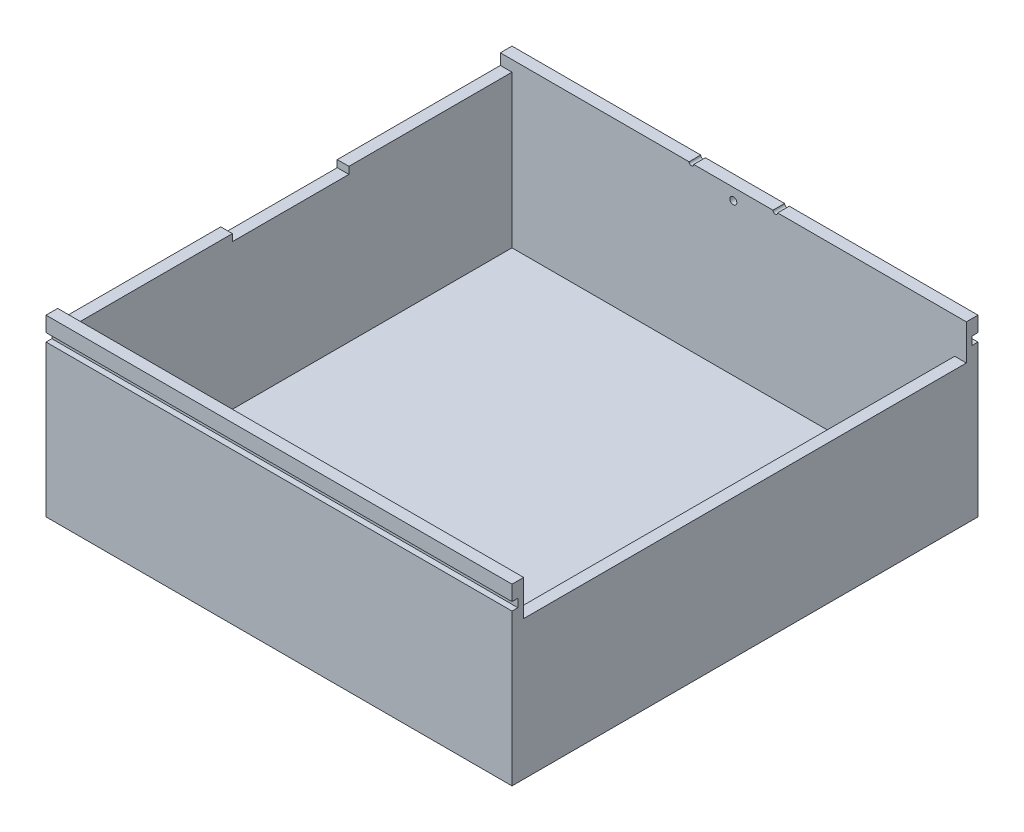
ISO-10303-21;
HEADER;
FILE_DESCRIPTION(('STEP AP214'),'2;1');
FILE_NAME('part.step','',(''),(''),'','','');
FILE_SCHEMA(('AUTOMOTIVE_DESIGN { 1 0 10303 214 1 1 1 1 }'));
ENDSEC;
DATA;
#1=APPLICATION_CONTEXT('core data for automotive mechanical design processes');
#2=APPLICATION_PROTOCOL_DEFINITION('international standard','automotive_design',2000,#1);
#3=PRODUCT_CONTEXT('',#1,'mechanical');
#4=PRODUCT('Part','Part','',(#3));
#5=PRODUCT_RELATED_PRODUCT_CATEGORY('part','',(#4));
#6=PRODUCT_DEFINITION_FORMATION('','',#4);
#7=PRODUCT_DEFINITION_CONTEXT('part definition',#1,'design');
#8=PRODUCT_DEFINITION('design','',#6,#7);
#9=PRODUCT_DEFINITION_SHAPE('','',#8);
#10=(LENGTH_UNIT() NAMED_UNIT(*) SI_UNIT(.MILLI.,.METRE.));
#11=(NAMED_UNIT(*) PLANE_ANGLE_UNIT() SI_UNIT($,.RADIAN.));
#12=(NAMED_UNIT(*) SI_UNIT($,.STERADIAN.) SOLID_ANGLE_UNIT());
#13=UNCERTAINTY_MEASURE_WITH_UNIT(LENGTH_MEASURE(1.E-05),#10,'distance_accuracy_value','');
#14=(GEOMETRIC_REPRESENTATION_CONTEXT(3) GLOBAL_UNCERTAINTY_ASSIGNED_CONTEXT((#13)) GLOBAL_UNIT_ASSIGNED_CONTEXT((#10,
#11,#12)) REPRESENTATION_CONTEXT('',''));
#15=CARTESIAN_POINT('',(0.,0.,0.));
#16=DIRECTION('',(0.,0.,1.));
#17=DIRECTION('',(1.,0.,0.));
#18=AXIS2_PLACEMENT_3D('',#15,#16,#17);
#19=CARTESIAN_POINT('',(100.,5.,100.));
#20=DIRECTION('',(0.,0.,-1.));
#21=DIRECTION('',(-1.,0.,0.));
#22=AXIS2_PLACEMENT_3D('',#19,#20,#21);
#23=PLANE('',#22);
#24=DIRECTION('',(0.,-1.,0.));
#25=VECTOR('',#24,1.);
#26=CARTESIAN_POINT('',(100.,5.,100.));
#27=LINE('',#26,#25);
#28=CARTESIAN_POINT('',(100.,65.,100.));
#29=VERTEX_POINT('',#28);
#30=CARTESIAN_POINT('',(100.,0.,100.));
#31=VERTEX_POINT('',#30);
#32=EDGE_CURVE('E475',#29,#31,#27,.T.);
#33=ORIENTED_EDGE('',*,*,#32,.F.);
#34=DIRECTION('',(1.,0.,0.));
#35=VECTOR('',#34,1.);
#36=CARTESIAN_POINT('',(100.,65.,100.));
#37=LINE('',#36,#35);
#38=CARTESIAN_POINT('',(-100.,65.,100.));
#39=VERTEX_POINT('',#38);
#40=EDGE_CURVE('E305',#39,#29,#37,.T.);
#41=ORIENTED_EDGE('',*,*,#40,.F.);
#42=DIRECTION('',(0.,-1.,0.));
#43=VECTOR('',#42,1.);
#44=CARTESIAN_POINT('',(-100.,5.,100.));
#45=LINE('',#44,#43);
#46=CARTESIAN_POINT('',(-100.,0.,100.));
#47=VERTEX_POINT('',#46);
#48=EDGE_CURVE('E43',#39,#47,#45,.T.);
#49=ORIENTED_EDGE('',*,*,#48,.T.);
#50=DIRECTION('',(1.,0.,0.));
#51=VECTOR('',#50,1.);
#52=CARTESIAN_POINT('',(100.,0.,100.));
#53=LINE('',#52,#51);
#54=EDGE_CURVE('E461',#47,#31,#53,.T.);
#55=ORIENTED_EDGE('',*,*,#54,.T.);
#56=EDGE_LOOP('',(#33,#41,#49,#55));
#57=FACE_BOUND('',#56,.T.);
#58=ADVANCED_FACE('F35',(#57),#23,.F.);
#59=CARTESIAN_POINT('',(100.,75.,-95.));
#60=DIRECTION('',(0.,0.,-1.));
#61=DIRECTION('',(-1.,0.,0.));
#62=AXIS2_PLACEMENT_3D('',#59,#60,#61);
#63=PLANE('',#62);
#64=CARTESIAN_POINT('',(0.,70.,-95.));
#65=DIRECTION('',(0.,0.,-1.));
#66=DIRECTION('',(-1.,0.,0.));
#67=AXIS2_PLACEMENT_3D('',#64,#65,#66);
#68=CIRCLE('',#67,1.5);
#69=CARTESIAN_POINT('',(-1.50000000000001,70.,-95.));
#70=VERTEX_POINT('',#69);
#71=EDGE_CURVE('E325',#70,#70,#68,.T.);
#72=ORIENTED_EDGE('',*,*,#71,.T.);
#73=EDGE_LOOP('',(#72));
#74=FACE_BOUND('',#73,.T.);
#75=CARTESIAN_POINT('',(-18.,75.,-95.));
#76=DIRECTION('',(0.,0.,1.));
#77=DIRECTION('',(1.,0.,0.));
#78=AXIS2_PLACEMENT_3D('',#75,#76,#77);
#79=CIRCLE('',#78,1.);
#80=CARTESIAN_POINT('',(-19.,75.,-95.));
#81=VERTEX_POINT('',#80);
#82=CARTESIAN_POINT('',(-17.,75.,-95.));
#83=VERTEX_POINT('',#82);
#84=EDGE_CURVE('E331',#81,#83,#79,.T.);
#85=ORIENTED_EDGE('',*,*,#84,.F.);
#86=DIRECTION('',(1.,0.,0.));
#87=VECTOR('',#86,1.);
#88=CARTESIAN_POINT('',(100.,75.,-95.));
#89=LINE('',#88,#87);
#90=CARTESIAN_POINT('',(-100.,75.,-95.));
#91=VERTEX_POINT('',#90);
#92=EDGE_CURVE('E410',#91,#81,#89,.T.);
#93=ORIENTED_EDGE('',*,*,#92,.F.);
#94=DIRECTION('',(0.,-1.,0.));
#95=VECTOR('',#94,1.);
#96=CARTESIAN_POINT('',(-100.,75.,-95.));
#97=LINE('',#96,#95);
#98=CARTESIAN_POINT('',(-100.,70.3,-95.));
#99=VERTEX_POINT('',#98);
#100=EDGE_CURVE('E418',#91,#99,#97,.T.);
#101=ORIENTED_EDGE('',*,*,#100,.T.);
#102=DIRECTION('',(-1.,0.,0.));
#103=VECTOR('',#102,1.);
#104=CARTESIAN_POINT('',(-100.,70.3,-95.));
#105=LINE('',#104,#103);
#106=CARTESIAN_POINT('',(-95.,70.3,-95.));
#107=VERTEX_POINT('',#106);
#108=EDGE_CURVE('E388',#107,#99,#105,.T.);
#109=ORIENTED_EDGE('',*,*,#108,.F.);
#110=DIRECTION('',(0.,-1.,0.));
#111=VECTOR('',#110,1.);
#112=CARTESIAN_POINT('',(-95.,70.3,-95.));
#113=LINE('',#112,#111);
#114=CARTESIAN_POINT('',(-95.,5.,-95.));
#115=VERTEX_POINT('',#114);
#116=EDGE_CURVE('E391',#107,#115,#113,.T.);
#117=ORIENTED_EDGE('',*,*,#116,.T.);
#118=DIRECTION('',(1.,0.,0.));
#119=VECTOR('',#118,1.);
#120=CARTESIAN_POINT('',(100.,5.,-95.));
#121=LINE('',#120,#119);
#122=CARTESIAN_POINT('',(95.,5.,-95.));
#123=VERTEX_POINT('',#122);
#124=EDGE_CURVE('E398',#115,#123,#121,.T.);
#125=ORIENTED_EDGE('',*,*,#124,.T.);
#126=DIRECTION('',(0.,-1.,0.));
#127=VECTOR('',#126,1.);
#128=CARTESIAN_POINT('',(95.,59.7,-95.));
#129=LINE('',#128,#127);
#130=CARTESIAN_POINT('',(95.,59.7,-95.));
#131=VERTEX_POINT('',#130);
#132=EDGE_CURVE('E436',#131,#123,#129,.T.);
#133=ORIENTED_EDGE('',*,*,#132,.F.);
#134=DIRECTION('',(-1.,0.,0.));
#135=VECTOR('',#134,1.);
#136=CARTESIAN_POINT('',(100.,59.7,-95.));
#137=LINE('',#136,#135);
#138=CARTESIAN_POINT('',(100.,59.7,-95.));
#139=VERTEX_POINT('',#138);
#140=EDGE_CURVE('E424',#139,#131,#137,.T.);
#141=ORIENTED_EDGE('',*,*,#140,.F.);
#142=DIRECTION('',(0.,-1.,0.));
#143=VECTOR('',#142,1.);
#144=CARTESIAN_POINT('',(100.,75.,-95.));
#145=LINE('',#144,#143);
#146=CARTESIAN_POINT('',(100.,75.,-95.));
#147=VERTEX_POINT('',#146);
#148=EDGE_CURVE('E413',#147,#139,#145,.T.);
#149=ORIENTED_EDGE('',*,*,#148,.F.);
#150=CARTESIAN_POINT('',(19.,75.,-95.));
#151=VERTEX_POINT('',#150);
#152=EDGE_CURVE('E409',#151,#147,#89,.T.);
#153=ORIENTED_EDGE('',*,*,#152,.F.);
#154=CARTESIAN_POINT('',(18.,75.,-95.));
#155=DIRECTION('',(0.,0.,1.));
#156=DIRECTION('',(1.,0.,0.));
#157=AXIS2_PLACEMENT_3D('',#154,#155,#156);
#158=CIRCLE('',#157,1.);
#159=CARTESIAN_POINT('',(17.,75.,-95.));
#160=VERTEX_POINT('',#159);
#161=EDGE_CURVE('E341',#160,#151,#158,.T.);
#162=ORIENTED_EDGE('',*,*,#161,.F.);
#163=EDGE_CURVE('E414',#83,#160,#89,.T.);
#164=ORIENTED_EDGE('',*,*,#163,.F.);
#165=EDGE_LOOP('',(#85,#93,#101,#109,#117,#125,#133,#141,#149,#153,#162,#164));
#166=FACE_BOUND('',#165,.T.);
#167=ADVANCED_FACE('F522',(#74,#166),#63,.F.);
#168=CARTESIAN_POINT('',(100.,5.,-100.));
#169=DIRECTION('',(0.,0.,1.));
#170=DIRECTION('',(1.,0.,0.));
#171=AXIS2_PLACEMENT_3D('',#168,#169,#170);
#172=PLANE('',#171);
#173=CARTESIAN_POINT('',(0.,70.,-100.));
#174=DIRECTION('',(0.,0.,-1.));
#175=DIRECTION('',(-1.,0.,0.));
#176=AXIS2_PLACEMENT_3D('',#173,#174,#175);
#177=CIRCLE('',#176,1.5);
#178=CARTESIAN_POINT('',(-1.50000000000002,70.,-100.));
#179=VERTEX_POINT('',#178);
#180=EDGE_CURVE('E318',#179,#179,#177,.T.);
#181=ORIENTED_EDGE('',*,*,#180,.F.);
#182=EDGE_LOOP('',(#181));
#183=FACE_BOUND('',#182,.T.);
#184=DIRECTION('',(0.,-1.,0.));
#185=VECTOR('',#184,1.);
#186=CARTESIAN_POINT('',(-100.,5.,-100.));
#187=LINE('',#186,#185);
#188=CARTESIAN_POINT('',(-100.,65.,-100.));
#189=VERTEX_POINT('',#188);
#190=CARTESIAN_POINT('',(-100.,0.,-100.));
#191=VERTEX_POINT('',#190);
#192=EDGE_CURVE('E470',#189,#191,#187,.T.);
#193=ORIENTED_EDGE('',*,*,#192,.F.);
#194=DIRECTION('',(-1.,0.,0.));
#195=VECTOR('',#194,1.);
#196=CARTESIAN_POINT('',(-100.,65.,-100.));
#197=LINE('',#196,#195);
#198=CARTESIAN_POINT('',(-18.,65.,-100.));
#199=VERTEX_POINT('',#198);
#200=EDGE_CURVE('E262',#199,#189,#197,.T.);
#201=ORIENTED_EDGE('',*,*,#200,.F.);
#202=DIRECTION('',(0.,-1.,0.));
#203=VECTOR('',#202,1.);
#204=CARTESIAN_POINT('',(-18.,68.5,-100.));
#205=LINE('',#204,#203);
#206=CARTESIAN_POINT('',(-18.,68.5,-100.));
#207=VERTEX_POINT('',#206);
#208=EDGE_CURVE('E554',#207,#199,#205,.T.);
#209=ORIENTED_EDGE('',*,*,#208,.F.);
#210=DIRECTION('',(1.,0.,0.));
#211=VECTOR('',#210,1.);
#212=CARTESIAN_POINT('',(-100.,68.5,-100.));
#213=LINE('',#212,#211);
#214=CARTESIAN_POINT('',(-100.,68.5,-100.));
#215=VERTEX_POINT('',#214);
#216=EDGE_CURVE('E557',#215,#207,#213,.T.);
#217=ORIENTED_EDGE('',*,*,#216,.F.);
#218=CARTESIAN_POINT('',(-100.,75.,-100.));
#219=VERTEX_POINT('',#218);
#220=EDGE_CURVE('E267',#219,#215,#187,.T.);
#221=ORIENTED_EDGE('',*,*,#220,.F.);
#222=DIRECTION('',(-1.,0.,0.));
#223=VECTOR('',#222,1.);
#224=CARTESIAN_POINT('',(100.,75.,-100.));
#225=LINE('',#224,#223);
#226=CARTESIAN_POINT('',(-19.,75.,-100.));
#227=VERTEX_POINT('',#226);
#228=EDGE_CURVE('E402',#227,#219,#225,.T.);
#229=ORIENTED_EDGE('',*,*,#228,.F.);
#230=CARTESIAN_POINT('',(-18.,75.,-100.));
#231=DIRECTION('',(0.,0.,1.));
#232=DIRECTION('',(1.,0.,0.));
#233=AXIS2_PLACEMENT_3D('',#230,#231,#232);
#234=CIRCLE('',#233,1.);
#235=CARTESIAN_POINT('',(-17.,75.,-100.));
#236=VERTEX_POINT('',#235);
#237=EDGE_CURVE('E328',#227,#236,#234,.T.);
#238=ORIENTED_EDGE('',*,*,#237,.T.);
#239=CARTESIAN_POINT('',(17.,75.,-100.));
#240=VERTEX_POINT('',#239);
#241=EDGE_CURVE('E407',#240,#236,#225,.T.);
#242=ORIENTED_EDGE('',*,*,#241,.F.);
#243=CARTESIAN_POINT('',(18.,75.,-100.));
#244=DIRECTION('',(0.,0.,1.));
#245=DIRECTION('',(1.,0.,0.));
#246=AXIS2_PLACEMENT_3D('',#243,#244,#245);
#247=CIRCLE('',#246,1.);
#248=CARTESIAN_POINT('',(19.,75.,-100.));
#249=VERTEX_POINT('',#248);
#250=EDGE_CURVE('E340',#240,#249,#247,.T.);
#251=ORIENTED_EDGE('',*,*,#250,.T.);
#252=CARTESIAN_POINT('',(100.,75.,-100.));
#253=VERTEX_POINT('',#252);
#254=EDGE_CURVE('E403',#253,#249,#225,.T.);
#255=ORIENTED_EDGE('',*,*,#254,.F.);
#256=DIRECTION('',(0.,-1.,0.));
#257=VECTOR('',#256,1.);
#258=CARTESIAN_POINT('',(100.,5.,-100.));
#259=LINE('',#258,#257);
#260=CARTESIAN_POINT('',(100.,68.5,-100.));
#261=VERTEX_POINT('',#260);
#262=EDGE_CURVE('E473',#253,#261,#259,.T.);
#263=ORIENTED_EDGE('',*,*,#262,.T.);
#264=DIRECTION('',(1.,0.,0.));
#265=VECTOR('',#264,1.);
#266=CARTESIAN_POINT('',(100.,68.5,-100.));
#267=LINE('',#266,#265);
#268=CARTESIAN_POINT('',(18.,68.5,-100.));
#269=VERTEX_POINT('',#268);
#270=EDGE_CURVE('E277',#269,#261,#267,.T.);
#271=ORIENTED_EDGE('',*,*,#270,.F.);
#272=DIRECTION('',(0.,1.,0.));
#273=VECTOR('',#272,1.);
#274=CARTESIAN_POINT('',(18.,68.5,-100.));
#275=LINE('',#274,#273);
#276=CARTESIAN_POINT('',(18.,65.,-100.));
#277=VERTEX_POINT('',#276);
#278=EDGE_CURVE('E287',#277,#269,#275,.T.);
#279=ORIENTED_EDGE('',*,*,#278,.F.);
#280=DIRECTION('',(-1.,0.,0.));
#281=VECTOR('',#280,1.);
#282=CARTESIAN_POINT('',(100.,65.,-100.));
#283=LINE('',#282,#281);
#284=CARTESIAN_POINT('',(100.,65.,-100.));
#285=VERTEX_POINT('',#284);
#286=EDGE_CURVE('E284',#285,#277,#283,.T.);
#287=ORIENTED_EDGE('',*,*,#286,.F.);
#288=CARTESIAN_POINT('',(100.,0.,-100.));
#289=VERTEX_POINT('',#288);
#290=EDGE_CURVE('E472',#285,#289,#259,.T.);
#291=ORIENTED_EDGE('',*,*,#290,.T.);
#292=DIRECTION('',(-1.,0.,0.));
#293=VECTOR('',#292,1.);
#294=CARTESIAN_POINT('',(100.,0.,-100.));
#295=LINE('',#294,#293);
#296=EDGE_CURVE('E467',#289,#191,#295,.T.);
#297=ORIENTED_EDGE('',*,*,#296,.T.);
#298=EDGE_LOOP('',(#193,#201,#209,#217,#221,#229,#238,#242,#251,#255,#263,#271,#279,#287,#291,#297));
#299=FACE_BOUND('',#298,.T.);
#300=ADVANCED_FACE('F498',(#183,#299),#172,.F.);
#301=CARTESIAN_POINT('',(0.,75.,0.));
#302=DIRECTION('',(0.,1.,0.));
#303=DIRECTION('',(0.,0.,1.));
#304=AXIS2_PLACEMENT_3D('',#301,#302,#303);
#305=PLANE('',#304);
#306=ORIENTED_EDGE('',*,*,#92,.T.);
#307=DIRECTION('',(0.,0.,1.));
#308=VECTOR('',#307,1.);
#309=CARTESIAN_POINT('',(-19.0000000000001,75.,-472.021872209988));
#310=LINE('',#309,#308);
#311=EDGE_CURVE('E333',#227,#81,#310,.T.);
#312=ORIENTED_EDGE('',*,*,#311,.F.);
#313=ORIENTED_EDGE('',*,*,#228,.T.);
#314=DIRECTION('',(0.,0.,1.));
#315=VECTOR('',#314,1.);
#316=CARTESIAN_POINT('',(-100.,75.,-95.));
#317=LINE('',#316,#315);
#318=EDGE_CURVE('E406',#219,#91,#317,.T.);
#319=ORIENTED_EDGE('',*,*,#318,.T.);
#320=EDGE_LOOP('',(#306,#312,#313,#319));
#321=FACE_BOUND('',#320,.T.);
#322=ADVANCED_FACE('F566',(#321),#305,.T.);
#323=ORIENTED_EDGE('',*,*,#241,.T.);
#324=DIRECTION('',(0.,0.,1.));
#325=VECTOR('',#324,1.);
#326=CARTESIAN_POINT('',(-17.0000000000001,75.,-472.021872209988));
#327=LINE('',#326,#325);
#328=EDGE_CURVE('E337',#236,#83,#327,.T.);
#329=ORIENTED_EDGE('',*,*,#328,.T.);
#330=ORIENTED_EDGE('',*,*,#163,.T.);
#331=DIRECTION('',(0.,0.,1.));
#332=VECTOR('',#331,1.);
#333=CARTESIAN_POINT('',(16.9999999999999,75.,-622.021872209988));
#334=LINE('',#333,#332);
#335=EDGE_CURVE('E343',#240,#160,#334,.T.);
#336=ORIENTED_EDGE('',*,*,#335,.F.);
#337=EDGE_LOOP('',(#323,#329,#330,#336));
#338=FACE_BOUND('',#337,.T.);
#339=ADVANCED_FACE('F572',(#338),#305,.T.);
#340=ORIENTED_EDGE('',*,*,#254,.T.);
#341=DIRECTION('',(0.,0.,1.));
#342=VECTOR('',#341,1.);
#343=CARTESIAN_POINT('',(18.9999999999999,75.,-622.021872209988));
#344=LINE('',#343,#342);
#345=EDGE_CURVE('E348',#249,#151,#344,.T.);
#346=ORIENTED_EDGE('',*,*,#345,.T.);
#347=ORIENTED_EDGE('',*,*,#152,.T.);
#348=DIRECTION('',(0.,0.,-1.));
#349=VECTOR('',#348,1.);
#350=CARTESIAN_POINT('',(100.,75.,-95.));
#351=LINE('',#350,#349);
#352=EDGE_CURVE('E399',#147,#253,#351,.T.);
#353=ORIENTED_EDGE('',*,*,#352,.T.);
#354=EDGE_LOOP('',(#340,#346,#347,#353));
#355=FACE_BOUND('',#354,.T.);
#356=ADVANCED_FACE('F583',(#355),#305,.T.);
#357=CARTESIAN_POINT('',(0.,70.3,0.));
#358=DIRECTION('',(0.,-1.,0.));
#359=DIRECTION('',(0.,0.,-1.));
#360=AXIS2_PLACEMENT_3D('',#357,#358,#359);
#361=PLANE('',#360);
#362=DIRECTION('',(0.,0.,-1.));
#363=VECTOR('',#362,1.);
#364=CARTESIAN_POINT('',(-95.,70.3,95.));
#365=LINE('',#364,#363);
#366=CARTESIAN_POINT('',(-95.,70.3,95.));
#367=VERTEX_POINT('',#366);
#368=CARTESIAN_POINT('',(-95.,70.3,25.));
#369=VERTEX_POINT('',#368);
#370=EDGE_CURVE('E385',#367,#369,#365,.T.);
#371=ORIENTED_EDGE('',*,*,#370,.T.);
#372=DIRECTION('',(1.,0.,0.));
#373=VECTOR('',#372,1.);
#374=CARTESIAN_POINT('',(-100.,70.3,25.));
#375=LINE('',#374,#373);
#376=CARTESIAN_POINT('',(-100.,70.3,25.));
#377=VERTEX_POINT('',#376);
#378=EDGE_CURVE('E356',#377,#369,#375,.T.);
#379=ORIENTED_EDGE('',*,*,#378,.F.);
#380=DIRECTION('',(0.,0.,1.));
#381=VECTOR('',#380,1.);
#382=CARTESIAN_POINT('',(-100.,70.3,95.));
#383=LINE('',#382,#381);
#384=CARTESIAN_POINT('',(-100.,70.3,95.));
#385=VERTEX_POINT('',#384);
#386=EDGE_CURVE('E381',#377,#385,#383,.T.);
#387=ORIENTED_EDGE('',*,*,#386,.T.);
#388=DIRECTION('',(1.,0.,0.));
#389=VECTOR('',#388,1.);
#390=CARTESIAN_POINT('',(-100.,70.3,95.));
#391=LINE('',#390,#389);
#392=EDGE_CURVE('E380',#385,#367,#391,.T.);
#393=ORIENTED_EDGE('',*,*,#392,.T.);
#394=EDGE_LOOP('',(#371,#379,#387,#393));
#395=FACE_BOUND('',#394,.T.);
#396=ADVANCED_FACE('F629',(#395),#361,.F.);
#397=CARTESIAN_POINT('',(0.,5.,0.));
#398=DIRECTION('',(0.,1.,0.));
#399=DIRECTION('',(0.,0.,1.));
#400=AXIS2_PLACEMENT_3D('',#397,#398,#399);
#401=PLANE('',#400);
#402=ORIENTED_EDGE('',*,*,#124,.F.);
#403=DIRECTION('',(0.,0.,-1.));
#404=VECTOR('',#403,1.);
#405=CARTESIAN_POINT('',(-95.,5.,95.));
#406=LINE('',#405,#404);
#407=CARTESIAN_POINT('',(-95.,5.,95.));
#408=VERTEX_POINT('',#407);
#409=EDGE_CURVE('E370',#408,#115,#406,.T.);
#410=ORIENTED_EDGE('',*,*,#409,.F.);
#411=DIRECTION('',(-1.,0.,0.));
#412=VECTOR('',#411,1.);
#413=CARTESIAN_POINT('',(-100.,5.,95.));
#414=LINE('',#413,#412);
#415=CARTESIAN_POINT('',(95.,5.,95.));
#416=VERTEX_POINT('',#415);
#417=EDGE_CURVE('E439',#416,#408,#414,.T.);
#418=ORIENTED_EDGE('',*,*,#417,.F.);
#419=DIRECTION('',(0.,0.,1.));
#420=VECTOR('',#419,1.);
#421=CARTESIAN_POINT('',(95.,5.,95.));
#422=LINE('',#421,#420);
#423=EDGE_CURVE('E420',#123,#416,#422,.T.);
#424=ORIENTED_EDGE('',*,*,#423,.F.);
#425=EDGE_LOOP('',(#402,#410,#418,#424));
#426=FACE_BOUND('',#425,.T.);
#427=ADVANCED_FACE('F649',(#426),#401,.T.);
#428=CARTESIAN_POINT('',(-100.,75.,95.));
#429=DIRECTION('',(0.,0.,1.));
#430=DIRECTION('',(1.,0.,0.));
#431=AXIS2_PLACEMENT_3D('',#428,#429,#430);
#432=PLANE('',#431);
#433=DIRECTION('',(0.,-1.,0.));
#434=VECTOR('',#433,1.);
#435=CARTESIAN_POINT('',(-95.,70.3,95.));
#436=LINE('',#435,#434);
#437=EDGE_CURVE('E395',#367,#408,#436,.T.);
#438=ORIENTED_EDGE('',*,*,#437,.F.);
#439=ORIENTED_EDGE('',*,*,#392,.F.);
#440=DIRECTION('',(0.,-1.,0.));
#441=VECTOR('',#440,1.);
#442=CARTESIAN_POINT('',(-100.,75.,95.));
#443=LINE('',#442,#441);
#444=CARTESIAN_POINT('',(-100.,75.,95.));
#445=VERTEX_POINT('',#444);
#446=EDGE_CURVE('E450',#445,#385,#443,.T.);
#447=ORIENTED_EDGE('',*,*,#446,.F.);
#448=DIRECTION('',(-1.,0.,0.));
#449=VECTOR('',#448,1.);
#450=CARTESIAN_POINT('',(-100.,75.,95.));
#451=LINE('',#450,#449);
#452=CARTESIAN_POINT('',(100.,75.,95.));
#453=VERTEX_POINT('',#452);
#454=EDGE_CURVE('E448',#453,#445,#451,.T.);
#455=ORIENTED_EDGE('',*,*,#454,.F.);
#456=DIRECTION('',(0.,-1.,0.));
#457=VECTOR('',#456,1.);
#458=CARTESIAN_POINT('',(100.,75.,95.));
#459=LINE('',#458,#457);
#460=CARTESIAN_POINT('',(100.,59.7,95.));
#461=VERTEX_POINT('',#460);
#462=EDGE_CURVE('E455',#453,#461,#459,.T.);
#463=ORIENTED_EDGE('',*,*,#462,.T.);
#464=DIRECTION('',(1.,0.,0.));
#465=VECTOR('',#464,1.);
#466=CARTESIAN_POINT('',(100.,59.7,95.));
#467=LINE('',#466,#465);
#468=CARTESIAN_POINT('',(95.,59.7,95.));
#469=VERTEX_POINT('',#468);
#470=EDGE_CURVE('E430',#469,#461,#467,.T.);
#471=ORIENTED_EDGE('',*,*,#470,.F.);
#472=DIRECTION('',(0.,-1.,0.));
#473=VECTOR('',#472,1.);
#474=CARTESIAN_POINT('',(95.,59.7,95.));
#475=LINE('',#474,#473);
#476=EDGE_CURVE('E432',#469,#416,#475,.T.);
#477=ORIENTED_EDGE('',*,*,#476,.T.);
#478=ORIENTED_EDGE('',*,*,#417,.T.);
#479=EDGE_LOOP('',(#438,#439,#447,#455,#463,#471,#477,#478));
#480=FACE_BOUND('',#479,.T.);
#481=ADVANCED_FACE('F538',(#480),#432,.F.);
#482=CARTESIAN_POINT('',(-100.,5.,100.));
#483=DIRECTION('',(1.,0.,0.));
#484=DIRECTION('',(0.,0.,-1.));
#485=AXIS2_PLACEMENT_3D('',#482,#483,#484);
#486=PLANE('',#485);
#487=DIRECTION('',(0.,1.,0.));
#488=VECTOR('',#487,1.);
#489=CARTESIAN_POINT('',(-100.,68.5,-97.5));
#490=LINE('',#489,#488);
#491=CARTESIAN_POINT('',(-100.,65.,-97.4999999999999));
#492=VERTEX_POINT('',#491);
#493=CARTESIAN_POINT('',(-100.,68.5,-97.5));
#494=VERTEX_POINT('',#493);
#495=EDGE_CURVE('E256',#492,#494,#490,.T.);
#496=ORIENTED_EDGE('',*,*,#495,.F.);
#497=DIRECTION('',(0.,0.,-1.));
#498=VECTOR('',#497,1.);
#499=CARTESIAN_POINT('',(-100.,65.,-97.5));
#500=LINE('',#499,#498);
#501=EDGE_CURVE('E288',#492,#189,#500,.T.);
#502=ORIENTED_EDGE('',*,*,#501,.T.);
#503=ORIENTED_EDGE('',*,*,#192,.T.);
#504=DIRECTION('',(0.,0.,1.));
#505=VECTOR('',#504,1.);
#506=CARTESIAN_POINT('',(-100.,0.,100.));
#507=LINE('',#506,#505);
#508=EDGE_CURVE('E458',#191,#47,#507,.T.);
#509=ORIENTED_EDGE('',*,*,#508,.T.);
#510=ORIENTED_EDGE('',*,*,#48,.F.);
#511=DIRECTION('',(0.,0.,1.));
#512=VECTOR('',#511,1.);
#513=CARTESIAN_POINT('',(-100.,65.,97.5));
#514=LINE('',#513,#512);
#515=CARTESIAN_POINT('',(-100.,65.,97.5));
#516=VERTEX_POINT('',#515);
#517=EDGE_CURVE('E319',#516,#39,#514,.T.);
#518=ORIENTED_EDGE('',*,*,#517,.F.);
#519=DIRECTION('',(0.,-1.,0.));
#520=VECTOR('',#519,1.);
#521=CARTESIAN_POINT('',(-100.,68.5,97.5));
#522=LINE('',#521,#520);
#523=CARTESIAN_POINT('',(-100.,68.5,97.5));
#524=VERTEX_POINT('',#523);
#525=EDGE_CURVE('E308',#524,#516,#522,.T.);
#526=ORIENTED_EDGE('',*,*,#525,.F.);
#527=DIRECTION('',(0.,0.,1.));
#528=VECTOR('',#527,1.);
#529=CARTESIAN_POINT('',(-100.,68.5,97.5));
#530=LINE('',#529,#528);
#531=CARTESIAN_POINT('',(-100.,68.5,100.));
#532=VERTEX_POINT('',#531);
#533=EDGE_CURVE('E321',#524,#532,#530,.T.);
#534=ORIENTED_EDGE('',*,*,#533,.T.);
#535=CARTESIAN_POINT('',(-100.,75.,100.));
#536=VERTEX_POINT('',#535);
#537=EDGE_CURVE('E11',#536,#532,#45,.T.);
#538=ORIENTED_EDGE('',*,*,#537,.F.);
#539=DIRECTION('',(0.,0.,1.));
#540=VECTOR('',#539,1.);
#541=CARTESIAN_POINT('',(-100.,75.,100.));
#542=LINE('',#541,#540);
#543=EDGE_CURVE('E440',#445,#536,#542,.T.);
#544=ORIENTED_EDGE('',*,*,#543,.F.);
#545=ORIENTED_EDGE('',*,*,#446,.T.);
#546=ORIENTED_EDGE('',*,*,#386,.F.);
#547=DIRECTION('',(0.,1.,0.));
#548=VECTOR('',#547,1.);
#549=CARTESIAN_POINT('',(-100.,67.3,25.));
#550=LINE('',#549,#548);
#551=CARTESIAN_POINT('',(-100.,67.3,25.));
#552=VERTEX_POINT('',#551);
#553=EDGE_CURVE('E371',#552,#377,#550,.T.);
#554=ORIENTED_EDGE('',*,*,#553,.F.);
#555=DIRECTION('',(0.,0.,1.));
#556=VECTOR('',#555,1.);
#557=CARTESIAN_POINT('',(-100.,67.3,25.));
#558=LINE('',#557,#556);
#559=CARTESIAN_POINT('',(-100.,67.3,-25.));
#560=VERTEX_POINT('',#559);
#561=EDGE_CURVE('E359',#560,#552,#558,.T.);
#562=ORIENTED_EDGE('',*,*,#561,.F.);
#563=DIRECTION('',(0.,1.,0.));
#564=VECTOR('',#563,1.);
#565=CARTESIAN_POINT('',(-100.,67.3,-25.));
#566=LINE('',#565,#564);
#567=CARTESIAN_POINT('',(-100.,70.3,-25.));
#568=VERTEX_POINT('',#567);
#569=EDGE_CURVE('E373',#560,#568,#566,.T.);
#570=ORIENTED_EDGE('',*,*,#569,.T.);
#571=EDGE_CURVE('E377',#99,#568,#383,.T.);
#572=ORIENTED_EDGE('',*,*,#571,.F.);
#573=ORIENTED_EDGE('',*,*,#100,.F.);
#574=ORIENTED_EDGE('',*,*,#318,.F.);
#575=ORIENTED_EDGE('',*,*,#220,.T.);
#576=DIRECTION('',(0.,0.,-1.));
#577=VECTOR('',#576,1.);
#578=CARTESIAN_POINT('',(-100.,68.5,-97.5));
#579=LINE('',#578,#577);
#580=EDGE_CURVE('E251',#494,#215,#579,.T.);
#581=ORIENTED_EDGE('',*,*,#580,.F.);
#582=EDGE_LOOP('',(#496,#502,#503,#509,#510,#518,#526,#534,#538,#544,#545,#546,#554,#562,#570,
#572,#573,#574,#575,#581));
#583=FACE_BOUND('',#582,.T.);
#584=ADVANCED_FACE('F37',(#583),#486,.F.);
#585=ORIENTED_EDGE('',*,*,#537,.T.);
#586=DIRECTION('',(-1.,0.,0.));
#587=VECTOR('',#586,1.);
#588=CARTESIAN_POINT('',(100.,68.5,100.));
#589=LINE('',#588,#587);
#590=CARTESIAN_POINT('',(100.,68.5,100.));
#591=VERTEX_POINT('',#590);
#592=EDGE_CURVE('E295',#591,#532,#589,.T.);
#593=ORIENTED_EDGE('',*,*,#592,.F.);
#594=CARTESIAN_POINT('',(100.,75.,100.));
#595=VERTEX_POINT('',#594);
#596=EDGE_CURVE('E476',#595,#591,#27,.T.);
#597=ORIENTED_EDGE('',*,*,#596,.F.);
#598=DIRECTION('',(1.,0.,0.));
#599=VECTOR('',#598,1.);
#600=CARTESIAN_POINT('',(-100.,75.,100.));
#601=LINE('',#600,#599);
#602=EDGE_CURVE('E443',#536,#595,#601,.T.);
#603=ORIENTED_EDGE('',*,*,#602,.F.);
#604=EDGE_LOOP('',(#585,#593,#597,#603));
#605=FACE_BOUND('',#604,.T.);
#606=ADVANCED_FACE('F523',(#605),#23,.F.);
#607=CARTESIAN_POINT('',(100.,5.,100.));
#608=DIRECTION('',(-1.,0.,0.));
#609=DIRECTION('',(0.,0.,1.));
#610=AXIS2_PLACEMENT_3D('',#607,#608,#609);
#611=PLANE('',#610);
#612=DIRECTION('',(0.,-1.,0.));
#613=VECTOR('',#612,1.);
#614=CARTESIAN_POINT('',(100.,68.5,-97.5));
#615=LINE('',#614,#613);
#616=CARTESIAN_POINT('',(100.,68.5,-97.5));
#617=VERTEX_POINT('',#616);
#618=CARTESIAN_POINT('',(100.,65.,-97.5));
#619=VERTEX_POINT('',#618);
#620=EDGE_CURVE('E274',#617,#619,#615,.T.);
#621=ORIENTED_EDGE('',*,*,#620,.F.);
#622=DIRECTION('',(0.,0.,-1.));
#623=VECTOR('',#622,1.);
#624=CARTESIAN_POINT('',(100.,68.5,-97.5));
#625=LINE('',#624,#623);
#626=EDGE_CURVE('E292',#617,#261,#625,.T.);
#627=ORIENTED_EDGE('',*,*,#626,.T.);
#628=ORIENTED_EDGE('',*,*,#262,.F.);
#629=ORIENTED_EDGE('',*,*,#352,.F.);
#630=ORIENTED_EDGE('',*,*,#148,.T.);
#631=DIRECTION('',(0.,0.,-1.));
#632=VECTOR('',#631,1.);
#633=CARTESIAN_POINT('',(100.,59.7,95.));
#634=LINE('',#633,#632);
#635=EDGE_CURVE('E421',#461,#139,#634,.T.);
#636=ORIENTED_EDGE('',*,*,#635,.F.);
#637=ORIENTED_EDGE('',*,*,#462,.F.);
#638=DIRECTION('',(0.,0.,-1.));
#639=VECTOR('',#638,1.);
#640=CARTESIAN_POINT('',(100.,75.,100.));
#641=LINE('',#640,#639);
#642=EDGE_CURVE('E446',#595,#453,#641,.T.);
#643=ORIENTED_EDGE('',*,*,#642,.F.);
#644=ORIENTED_EDGE('',*,*,#596,.T.);
#645=DIRECTION('',(0.,0.,1.));
#646=VECTOR('',#645,1.);
#647=CARTESIAN_POINT('',(100.,68.5,97.5));
#648=LINE('',#647,#646);
#649=CARTESIAN_POINT('',(100.,68.5,97.5));
#650=VERTEX_POINT('',#649);
#651=EDGE_CURVE('E312',#650,#591,#648,.T.);
#652=ORIENTED_EDGE('',*,*,#651,.F.);
#653=DIRECTION('',(0.,1.,0.));
#654=VECTOR('',#653,1.);
#655=CARTESIAN_POINT('',(100.,68.5,97.5));
#656=LINE('',#655,#654);
#657=CARTESIAN_POINT('',(100.,65.,97.5));
#658=VERTEX_POINT('',#657);
#659=EDGE_CURVE('E301',#658,#650,#656,.T.);
#660=ORIENTED_EDGE('',*,*,#659,.F.);
#661=DIRECTION('',(0.,0.,1.));
#662=VECTOR('',#661,1.);
#663=CARTESIAN_POINT('',(100.,65.,97.5));
#664=LINE('',#663,#662);
#665=EDGE_CURVE('E315',#658,#29,#664,.T.);
#666=ORIENTED_EDGE('',*,*,#665,.T.);
#667=ORIENTED_EDGE('',*,*,#32,.T.);
#668=DIRECTION('',(0.,0.,-1.));
#669=VECTOR('',#668,1.);
#670=CARTESIAN_POINT('',(100.,0.,100.));
#671=LINE('',#670,#669);
#672=EDGE_CURVE('E464',#31,#289,#671,.T.);
#673=ORIENTED_EDGE('',*,*,#672,.T.);
#674=ORIENTED_EDGE('',*,*,#290,.F.);
#675=DIRECTION('',(0.,0.,-1.));
#676=VECTOR('',#675,1.);
#677=CARTESIAN_POINT('',(100.,65.,-97.5));
#678=LINE('',#677,#676);
#679=EDGE_CURVE('E283',#619,#285,#678,.T.);
#680=ORIENTED_EDGE('',*,*,#679,.F.);
#681=EDGE_LOOP('',(#621,#627,#628,#629,#630,#636,#637,#643,#644,#652,#660,#666,#667,#673,#674,#680));
#682=FACE_BOUND('',#681,.T.);
#683=ADVANCED_FACE('F483',(#682),#611,.F.);
#684=CARTESIAN_POINT('',(0.,0.,0.));
#685=DIRECTION('',(0.,1.,0.));
#686=DIRECTION('',(0.,0.,1.));
#687=AXIS2_PLACEMENT_3D('',#684,#685,#686);
#688=PLANE('',#687);
#689=ORIENTED_EDGE('',*,*,#508,.F.);
#690=ORIENTED_EDGE('',*,*,#296,.F.);
#691=ORIENTED_EDGE('',*,*,#672,.F.);
#692=ORIENTED_EDGE('',*,*,#54,.F.);
#693=EDGE_LOOP('',(#689,#690,#691,#692));
#694=FACE_BOUND('',#693,.T.);
#695=ADVANCED_FACE('F495',(#694),#688,.F.);
#696=CARTESIAN_POINT('',(0.,75.,0.));
#697=DIRECTION('',(0.,-1.,0.));
#698=DIRECTION('',(0.,0.,-1.));
#699=AXIS2_PLACEMENT_3D('',#696,#697,#698);
#700=PLANE('',#699);
#701=ORIENTED_EDGE('',*,*,#543,.T.);
#702=ORIENTED_EDGE('',*,*,#602,.T.);
#703=ORIENTED_EDGE('',*,*,#642,.T.);
#704=ORIENTED_EDGE('',*,*,#454,.T.);
#705=EDGE_LOOP('',(#701,#702,#703,#704));
#706=FACE_BOUND('',#705,.T.);
#707=ADVANCED_FACE('F642',(#706),#700,.F.);
#708=CARTESIAN_POINT('',(95.,59.7,95.));
#709=DIRECTION('',(1.,0.,0.));
#710=DIRECTION('',(0.,0.,-1.));
#711=AXIS2_PLACEMENT_3D('',#708,#709,#710);
#712=PLANE('',#711);
#713=ORIENTED_EDGE('',*,*,#423,.T.);
#714=ORIENTED_EDGE('',*,*,#476,.F.);
#715=DIRECTION('',(0.,0.,1.));
#716=VECTOR('',#715,1.);
#717=CARTESIAN_POINT('',(95.,59.7,95.));
#718=LINE('',#717,#716);
#719=EDGE_CURVE('E427',#131,#469,#718,.T.);
#720=ORIENTED_EDGE('',*,*,#719,.F.);
#721=ORIENTED_EDGE('',*,*,#132,.T.);
#722=EDGE_LOOP('',(#713,#714,#720,#721));
#723=FACE_BOUND('',#722,.T.);
#724=ADVANCED_FACE('F638',(#723),#712,.F.);
#725=CARTESIAN_POINT('',(0.,59.7,0.));
#726=DIRECTION('',(0.,1.,0.));
#727=DIRECTION('',(0.,0.,1.));
#728=AXIS2_PLACEMENT_3D('',#725,#726,#727);
#729=PLANE('',#728);
#730=ORIENTED_EDGE('',*,*,#635,.T.);
#731=ORIENTED_EDGE('',*,*,#140,.T.);
#732=ORIENTED_EDGE('',*,*,#719,.T.);
#733=ORIENTED_EDGE('',*,*,#470,.T.);
#734=EDGE_LOOP('',(#730,#731,#732,#733));
#735=FACE_BOUND('',#734,.T.);
#736=ADVANCED_FACE('F632',(#735),#729,.T.);
#737=CARTESIAN_POINT('',(-95.,70.3,95.));
#738=DIRECTION('',(-1.,0.,0.));
#739=DIRECTION('',(0.,0.,1.));
#740=AXIS2_PLACEMENT_3D('',#737,#738,#739);
#741=PLANE('',#740);
#742=DIRECTION('',(0.,0.,-1.));
#743=VECTOR('',#742,1.);
#744=CARTESIAN_POINT('',(-95.,67.3,25.));
#745=LINE('',#744,#743);
#746=CARTESIAN_POINT('',(-95.,67.3,25.));
#747=VERTEX_POINT('',#746);
#748=CARTESIAN_POINT('',(-95.,67.3,-25.));
#749=VERTEX_POINT('',#748);
#750=EDGE_CURVE('E352',#747,#749,#745,.T.);
#751=ORIENTED_EDGE('',*,*,#750,.F.);
#752=DIRECTION('',(0.,1.,0.));
#753=VECTOR('',#752,1.);
#754=CARTESIAN_POINT('',(-95.,67.3,25.));
#755=LINE('',#754,#753);
#756=EDGE_CURVE('E367',#747,#369,#755,.T.);
#757=ORIENTED_EDGE('',*,*,#756,.T.);
#758=ORIENTED_EDGE('',*,*,#370,.F.);
#759=ORIENTED_EDGE('',*,*,#437,.T.);
#760=ORIENTED_EDGE('',*,*,#409,.T.);
#761=ORIENTED_EDGE('',*,*,#116,.F.);
#762=CARTESIAN_POINT('',(-95.,70.3,-25.));
#763=VERTEX_POINT('',#762);
#764=EDGE_CURVE('E384',#763,#107,#365,.T.);
#765=ORIENTED_EDGE('',*,*,#764,.F.);
#766=DIRECTION('',(0.,1.,0.));
#767=VECTOR('',#766,1.);
#768=CARTESIAN_POINT('',(-95.,67.3,-25.));
#769=LINE('',#768,#767);
#770=EDGE_CURVE('E364',#749,#763,#769,.T.);
#771=ORIENTED_EDGE('',*,*,#770,.F.);
#772=EDGE_LOOP('',(#751,#757,#758,#759,#760,#761,#765,#771));
#773=FACE_BOUND('',#772,.T.);
#774=ADVANCED_FACE('F627',(#773),#741,.F.);
#775=ORIENTED_EDGE('',*,*,#571,.T.);
#776=DIRECTION('',(-1.,0.,0.));
#777=VECTOR('',#776,1.);
#778=CARTESIAN_POINT('',(-100.,70.3,-25.));
#779=LINE('',#778,#777);
#780=EDGE_CURVE('E351',#763,#568,#779,.T.);
#781=ORIENTED_EDGE('',*,*,#780,.F.);
#782=ORIENTED_EDGE('',*,*,#764,.T.);
#783=ORIENTED_EDGE('',*,*,#108,.T.);
#784=EDGE_LOOP('',(#775,#781,#782,#783));
#785=FACE_BOUND('',#784,.T.);
#786=ADVANCED_FACE('F620',(#785),#361,.F.);
#787=CARTESIAN_POINT('',(-100.,67.3,25.));
#788=DIRECTION('',(0.,0.,1.));
#789=DIRECTION('',(1.,0.,0.));
#790=AXIS2_PLACEMENT_3D('',#787,#788,#789);
#791=PLANE('',#790);
#792=ORIENTED_EDGE('',*,*,#378,.T.);
#793=ORIENTED_EDGE('',*,*,#756,.F.);
#794=DIRECTION('',(1.,0.,0.));
#795=VECTOR('',#794,1.);
#796=CARTESIAN_POINT('',(-100.,67.3,25.));
#797=LINE('',#796,#795);
#798=EDGE_CURVE('E361',#552,#747,#797,.T.);
#799=ORIENTED_EDGE('',*,*,#798,.F.);
#800=ORIENTED_EDGE('',*,*,#553,.T.);
#801=EDGE_LOOP('',(#792,#793,#799,#800));
#802=FACE_BOUND('',#801,.T.);
#803=ADVANCED_FACE('F617',(#802),#791,.F.);
#804=CARTESIAN_POINT('',(-100.,67.3,-25.));
#805=DIRECTION('',(0.,0.,-1.));
#806=DIRECTION('',(-1.,0.,0.));
#807=AXIS2_PLACEMENT_3D('',#804,#805,#806);
#808=PLANE('',#807);
#809=ORIENTED_EDGE('',*,*,#780,.T.);
#810=ORIENTED_EDGE('',*,*,#569,.F.);
#811=DIRECTION('',(-1.,0.,0.));
#812=VECTOR('',#811,1.);
#813=CARTESIAN_POINT('',(-100.,67.3,-25.));
#814=LINE('',#813,#812);
#815=EDGE_CURVE('E355',#749,#560,#814,.T.);
#816=ORIENTED_EDGE('',*,*,#815,.F.);
#817=ORIENTED_EDGE('',*,*,#770,.T.);
#818=EDGE_LOOP('',(#809,#810,#816,#817));
#819=FACE_BOUND('',#818,.T.);
#820=ADVANCED_FACE('F615',(#819),#808,.F.);
#821=CARTESIAN_POINT('',(0.,67.3,0.));
#822=DIRECTION('',(0.,-1.,0.));
#823=DIRECTION('',(0.,0.,-1.));
#824=AXIS2_PLACEMENT_3D('',#821,#822,#823);
#825=PLANE('',#824);
#826=ORIENTED_EDGE('',*,*,#750,.T.);
#827=ORIENTED_EDGE('',*,*,#815,.T.);
#828=ORIENTED_EDGE('',*,*,#561,.T.);
#829=ORIENTED_EDGE('',*,*,#798,.T.);
#830=EDGE_LOOP('',(#826,#827,#828,#829));
#831=FACE_BOUND('',#830,.T.);
#832=ADVANCED_FACE('F611',(#831),#825,.F.);
#833=CARTESIAN_POINT('',(17.9999999999999,75.,-622.021872209988));
#834=DIRECTION('',(0.,0.,1.));
#835=DIRECTION('',(1.,0.,0.));
#836=AXIS2_PLACEMENT_3D('',#833,#834,#835);
#837=CYLINDRICAL_SURFACE('',#836,1.);
#838=ORIENTED_EDGE('',*,*,#250,.F.);
#839=ORIENTED_EDGE('',*,*,#335,.T.);
#840=ORIENTED_EDGE('',*,*,#161,.T.);
#841=ORIENTED_EDGE('',*,*,#345,.F.);
#842=EDGE_LOOP('',(#838,#839,#840,#841));
#843=FACE_BOUND('',#842,.T.);
#844=ADVANCED_FACE('F608',(#843),#837,.F.);
#845=CARTESIAN_POINT('',(-18.0000000000001,75.,-472.021872209988));
#846=DIRECTION('',(0.,0.,1.));
#847=DIRECTION('',(1.,0.,0.));
#848=AXIS2_PLACEMENT_3D('',#845,#846,#847);
#849=CYLINDRICAL_SURFACE('',#848,1.);
#850=ORIENTED_EDGE('',*,*,#237,.F.);
#851=ORIENTED_EDGE('',*,*,#311,.T.);
#852=ORIENTED_EDGE('',*,*,#84,.T.);
#853=ORIENTED_EDGE('',*,*,#328,.F.);
#854=EDGE_LOOP('',(#850,#851,#852,#853));
#855=FACE_BOUND('',#854,.T.);
#856=ADVANCED_FACE('F576',(#855),#849,.F.);
#857=CARTESIAN_POINT('',(0.,70.,-95.));
#858=DIRECTION('',(0.,0.,-1.));
#859=DIRECTION('',(-1.,0.,0.));
#860=AXIS2_PLACEMENT_3D('',#857,#858,#859);
#861=CYLINDRICAL_SURFACE('',#860,1.5);
#862=ORIENTED_EDGE('',*,*,#71,.F.);
#863=EDGE_LOOP('',(#862));
#864=FACE_BOUND('',#863,.T.);
#865=ORIENTED_EDGE('',*,*,#180,.T.);
#866=EDGE_LOOP('',(#865));
#867=FACE_BOUND('',#866,.T.);
#868=ADVANCED_FACE('F600',(#864,#867),#861,.F.);
#869=CARTESIAN_POINT('',(100.,65.,97.5));
#870=DIRECTION('',(0.,-1.,0.));
#871=DIRECTION('',(1.,0.,0.));
#872=AXIS2_PLACEMENT_3D('',#869,#870,#871);
#873=PLANE('',#872);
#874=ORIENTED_EDGE('',*,*,#40,.T.);
#875=ORIENTED_EDGE('',*,*,#665,.F.);
#876=DIRECTION('',(1.,0.,0.));
#877=VECTOR('',#876,1.);
#878=CARTESIAN_POINT('',(100.,65.,97.5));
#879=LINE('',#878,#877);
#880=EDGE_CURVE('E310',#516,#658,#879,.T.);
#881=ORIENTED_EDGE('',*,*,#880,.F.);
#882=ORIENTED_EDGE('',*,*,#517,.T.);
#883=EDGE_LOOP('',(#874,#875,#881,#882));
#884=FACE_BOUND('',#883,.T.);
#885=ADVANCED_FACE('F550',(#884),#873,.F.);
#886=CARTESIAN_POINT('',(100.,68.5,97.5));
#887=DIRECTION('',(0.,1.,0.));
#888=DIRECTION('',(0.,0.,1.));
#889=AXIS2_PLACEMENT_3D('',#886,#887,#888);
#890=PLANE('',#889);
#891=ORIENTED_EDGE('',*,*,#592,.T.);
#892=ORIENTED_EDGE('',*,*,#533,.F.);
#893=DIRECTION('',(-1.,0.,0.));
#894=VECTOR('',#893,1.);
#895=CARTESIAN_POINT('',(100.,68.5,97.5));
#896=LINE('',#895,#894);
#897=EDGE_CURVE('E304',#650,#524,#896,.T.);
#898=ORIENTED_EDGE('',*,*,#897,.F.);
#899=ORIENTED_EDGE('',*,*,#651,.T.);
#900=EDGE_LOOP('',(#891,#892,#898,#899));
#901=FACE_BOUND('',#900,.T.);
#902=ADVANCED_FACE('F545',(#901),#890,.F.);
#903=CARTESIAN_POINT('',(0.,0.,97.5));
#904=DIRECTION('',(0.,0.,-1.));
#905=DIRECTION('',(-1.,0.,0.));
#906=AXIS2_PLACEMENT_3D('',#903,#904,#905);
#907=PLANE('',#906);
#908=ORIENTED_EDGE('',*,*,#659,.T.);
#909=ORIENTED_EDGE('',*,*,#897,.T.);
#910=ORIENTED_EDGE('',*,*,#525,.T.);
#911=ORIENTED_EDGE('',*,*,#880,.T.);
#912=EDGE_LOOP('',(#908,#909,#910,#911));
#913=FACE_BOUND('',#912,.T.);
#914=ADVANCED_FACE('F547',(#913),#907,.F.);
#915=CARTESIAN_POINT('',(100.,68.5,-97.5));
#916=DIRECTION('',(0.,1.,0.));
#917=DIRECTION('',(0.,0.,1.));
#918=AXIS2_PLACEMENT_3D('',#915,#916,#917);
#919=PLANE('',#918);
#920=ORIENTED_EDGE('',*,*,#270,.T.);
#921=ORIENTED_EDGE('',*,*,#626,.F.);
#922=DIRECTION('',(1.,0.,0.));
#923=VECTOR('',#922,1.);
#924=CARTESIAN_POINT('',(100.,68.5,-97.5));
#925=LINE('',#924,#923);
#926=CARTESIAN_POINT('',(18.,68.5,-97.5));
#927=VERTEX_POINT('',#926);
#928=EDGE_CURVE('E58',#927,#617,#925,.T.);
#929=ORIENTED_EDGE('',*,*,#928,.F.);
#930=DIRECTION('',(0.,0.,-1.));
#931=VECTOR('',#930,1.);
#932=CARTESIAN_POINT('',(18.,68.5,-97.5));
#933=LINE('',#932,#931);
#934=EDGE_CURVE('E296',#927,#269,#933,.T.);
#935=ORIENTED_EDGE('',*,*,#934,.T.);
#936=EDGE_LOOP('',(#920,#921,#929,#935));
#937=FACE_BOUND('',#936,.T.);
#938=ADVANCED_FACE('F588',(#937),#919,.F.);
#939=CARTESIAN_POINT('',(18.,68.5,-97.5));
#940=DIRECTION('',(-1.,0.,0.));
#941=DIRECTION('',(0.,-1.,0.));
#942=AXIS2_PLACEMENT_3D('',#939,#940,#941);
#943=PLANE('',#942);
#944=ORIENTED_EDGE('',*,*,#278,.T.);
#945=ORIENTED_EDGE('',*,*,#934,.F.);
#946=DIRECTION('',(0.,1.,0.));
#947=VECTOR('',#946,1.);
#948=CARTESIAN_POINT('',(18.,68.5,-97.5));
#949=LINE('',#948,#947);
#950=CARTESIAN_POINT('',(18.,65.,-97.5));
#951=VERTEX_POINT('',#950);
#952=EDGE_CURVE('E280',#951,#927,#949,.T.);
#953=ORIENTED_EDGE('',*,*,#952,.F.);
#954=DIRECTION('',(0.,0.,-1.));
#955=VECTOR('',#954,1.);
#956=CARTESIAN_POINT('',(18.,65.,-97.5));
#957=LINE('',#956,#955);
#958=EDGE_CURVE('E298',#951,#277,#957,.T.);
#959=ORIENTED_EDGE('',*,*,#958,.T.);
#960=EDGE_LOOP('',(#944,#945,#953,#959));
#961=FACE_BOUND('',#960,.T.);
#962=ADVANCED_FACE('F517',(#961),#943,.F.);
#963=CARTESIAN_POINT('',(100.,65.,-97.5));
#964=DIRECTION('',(0.,-1.,0.));
#965=DIRECTION('',(0.,0.,-1.));
#966=AXIS2_PLACEMENT_3D('',#963,#964,#965);
#967=PLANE('',#966);
#968=ORIENTED_EDGE('',*,*,#286,.T.);
#969=ORIENTED_EDGE('',*,*,#958,.F.);
#970=DIRECTION('',(-1.,0.,0.));
#971=VECTOR('',#970,1.);
#972=CARTESIAN_POINT('',(100.,65.,-97.5));
#973=LINE('',#972,#971);
#974=EDGE_CURVE('E276',#619,#951,#973,.T.);
#975=ORIENTED_EDGE('',*,*,#974,.F.);
#976=ORIENTED_EDGE('',*,*,#679,.T.);
#977=EDGE_LOOP('',(#968,#969,#975,#976));
#978=FACE_BOUND('',#977,.T.);
#979=ADVANCED_FACE('F504',(#978),#967,.F.);
#980=CARTESIAN_POINT('',(0.,0.,-97.5));
#981=DIRECTION('',(0.,0.,-1.));
#982=DIRECTION('',(-1.,0.,0.));
#983=AXIS2_PLACEMENT_3D('',#980,#981,#982);
#984=PLANE('',#983);
#985=ORIENTED_EDGE('',*,*,#620,.T.);
#986=ORIENTED_EDGE('',*,*,#974,.T.);
#987=ORIENTED_EDGE('',*,*,#952,.T.);
#988=ORIENTED_EDGE('',*,*,#928,.T.);
#989=EDGE_LOOP('',(#985,#986,#987,#988));
#990=FACE_BOUND('',#989,.T.);
#991=ADVANCED_FACE('F506',(#990),#984,.T.);
#992=CARTESIAN_POINT('',(-100.,65.,-97.5));
#993=DIRECTION('',(0.,-1.,0.));
#994=DIRECTION('',(1.,0.,0.));
#995=AXIS2_PLACEMENT_3D('',#992,#993,#994);
#996=PLANE('',#995);
#997=ORIENTED_EDGE('',*,*,#200,.T.);
#998=ORIENTED_EDGE('',*,*,#501,.F.);
#999=DIRECTION('',(-1.,0.,0.));
#1000=VECTOR('',#999,1.);
#1001=CARTESIAN_POINT('',(-100.,65.,-97.5));
#1002=LINE('',#1001,#1000);
#1003=CARTESIAN_POINT('',(-18.,65.,-97.5));
#1004=VERTEX_POINT('',#1003);
#1005=EDGE_CURVE('E50',#1004,#492,#1002,.T.);
#1006=ORIENTED_EDGE('',*,*,#1005,.F.);
#1007=DIRECTION('',(0.,0.,-1.));
#1008=VECTOR('',#1007,1.);
#1009=CARTESIAN_POINT('',(-18.,65.,-97.5));
#1010=LINE('',#1009,#1008);
#1011=EDGE_CURVE('E269',#1004,#199,#1010,.T.);
#1012=ORIENTED_EDGE('',*,*,#1011,.T.);
#1013=EDGE_LOOP('',(#997,#998,#1006,#1012));
#1014=FACE_BOUND('',#1013,.T.);
#1015=ADVANCED_FACE('F508',(#1014),#996,.F.);
#1016=CARTESIAN_POINT('',(-18.,68.5,-97.5));
#1017=DIRECTION('',(1.,0.,0.));
#1018=DIRECTION('',(0.,1.,0.));
#1019=AXIS2_PLACEMENT_3D('',#1016,#1017,#1018);
#1020=PLANE('',#1019);
#1021=ORIENTED_EDGE('',*,*,#208,.T.);
#1022=ORIENTED_EDGE('',*,*,#1011,.F.);
#1023=DIRECTION('',(0.,-1.,0.));
#1024=VECTOR('',#1023,1.);
#1025=CARTESIAN_POINT('',(-18.,68.5,-97.5));
#1026=LINE('',#1025,#1024);
#1027=CARTESIAN_POINT('',(-18.,68.5,-97.5));
#1028=VERTEX_POINT('',#1027);
#1029=EDGE_CURVE('E255',#1028,#1004,#1026,.T.);
#1030=ORIENTED_EDGE('',*,*,#1029,.F.);
#1031=DIRECTION('',(0.,0.,-1.));
#1032=VECTOR('',#1031,1.);
#1033=CARTESIAN_POINT('',(-18.,68.5,-97.5));
#1034=LINE('',#1033,#1032);
#1035=EDGE_CURVE('E253',#1028,#207,#1034,.T.);
#1036=ORIENTED_EDGE('',*,*,#1035,.T.);
#1037=EDGE_LOOP('',(#1021,#1022,#1030,#1036));
#1038=FACE_BOUND('',#1037,.T.);
#1039=ADVANCED_FACE('F514',(#1038),#1020,.F.);
#1040=CARTESIAN_POINT('',(-100.,68.5,-97.5));
#1041=DIRECTION('',(0.,1.,0.));
#1042=DIRECTION('',(0.,0.,1.));
#1043=AXIS2_PLACEMENT_3D('',#1040,#1041,#1042);
#1044=PLANE('',#1043);
#1045=ORIENTED_EDGE('',*,*,#216,.T.);
#1046=ORIENTED_EDGE('',*,*,#1035,.F.);
#1047=DIRECTION('',(1.,0.,0.));
#1048=VECTOR('',#1047,1.);
#1049=CARTESIAN_POINT('',(-100.,68.5,-97.5));
#1050=LINE('',#1049,#1048);
#1051=EDGE_CURVE('E247',#494,#1028,#1050,.T.);
#1052=ORIENTED_EDGE('',*,*,#1051,.F.);
#1053=ORIENTED_EDGE('',*,*,#580,.T.);
#1054=EDGE_LOOP('',(#1045,#1046,#1052,#1053));
#1055=FACE_BOUND('',#1054,.T.);
#1056=ADVANCED_FACE('F249',(#1055),#1044,.F.);
#1057=CARTESIAN_POINT('',(0.,0.,-97.5));
#1058=DIRECTION('',(0.,0.,1.));
#1059=DIRECTION('',(1.,0.,0.));
#1060=AXIS2_PLACEMENT_3D('',#1057,#1058,#1059);
#1061=PLANE('',#1060);
#1062=ORIENTED_EDGE('',*,*,#495,.T.);
#1063=ORIENTED_EDGE('',*,*,#1051,.T.);
#1064=ORIENTED_EDGE('',*,*,#1029,.T.);
#1065=ORIENTED_EDGE('',*,*,#1005,.T.);
#1066=EDGE_LOOP('',(#1062,#1063,#1064,#1065));
#1067=FACE_BOUND('',#1066,.T.);
#1068=ADVANCED_FACE('F259',(#1067),#1061,.F.);
#1069=CLOSED_SHELL('',(#58,#167,#300,#322,#339,#356,#396,#427,#481,#584,#606,#683,#695,#707,
#724,#736,#774,#786,#803,#820,#832,#844,#856,#868,#885,#902,#914,#938,#962,#979,#991,#1015,
#1039,#1056,#1068));
#1070=MANIFOLD_SOLID_BREP('B2',#1069);
#1071=ADVANCED_BREP_SHAPE_REPRESENTATION('',(#18,#1070),#14);
#1072=SHAPE_DEFINITION_REPRESENTATION(#9,#1071);
ENDSEC;
END-ISO-10303-21;
